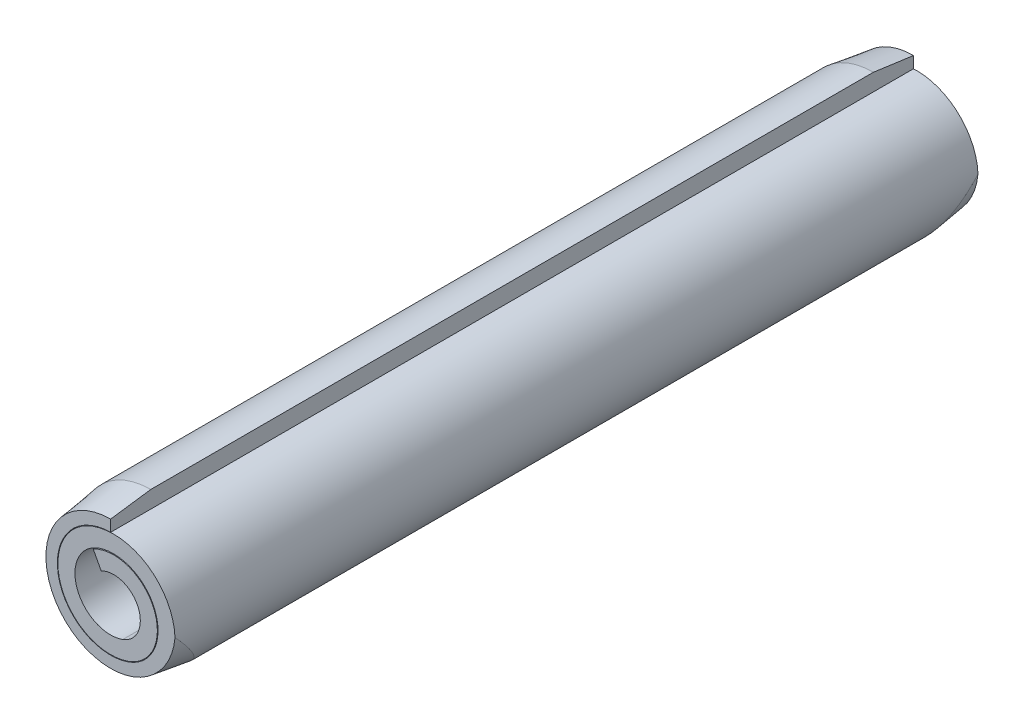
ISO-10303-21;
HEADER;
FILE_DESCRIPTION(('STEP AP214'),'2;1');
FILE_NAME('part.step','',(''),(''),'','','');
FILE_SCHEMA(('AUTOMOTIVE_DESIGN { 1 0 10303 214 1 1 1 1 }'));
ENDSEC;
DATA;
#1=APPLICATION_CONTEXT('core data for automotive mechanical design processes');
#2=APPLICATION_PROTOCOL_DEFINITION('international standard','automotive_design',2000,#1);
#3=PRODUCT_CONTEXT('',#1,'mechanical');
#4=PRODUCT('Part','Part','',(#3));
#5=PRODUCT_RELATED_PRODUCT_CATEGORY('part','',(#4));
#6=PRODUCT_DEFINITION_FORMATION('','',#4);
#7=PRODUCT_DEFINITION_CONTEXT('part definition',#1,'design');
#8=PRODUCT_DEFINITION('design','',#6,#7);
#9=PRODUCT_DEFINITION_SHAPE('','',#8);
#10=(LENGTH_UNIT() NAMED_UNIT(*) SI_UNIT(.MILLI.,.METRE.));
#11=(NAMED_UNIT(*) PLANE_ANGLE_UNIT() SI_UNIT($,.RADIAN.));
#12=(NAMED_UNIT(*) SI_UNIT($,.STERADIAN.) SOLID_ANGLE_UNIT());
#13=UNCERTAINTY_MEASURE_WITH_UNIT(LENGTH_MEASURE(1.E-05),#10,'distance_accuracy_value','');
#14=(GEOMETRIC_REPRESENTATION_CONTEXT(3) GLOBAL_UNCERTAINTY_ASSIGNED_CONTEXT((#13)) GLOBAL_UNIT_ASSIGNED_CONTEXT((#10,
#11,#12)) REPRESENTATION_CONTEXT('',''));
#15=CARTESIAN_POINT('',(0.,0.,0.));
#16=DIRECTION('',(0.,0.,1.));
#17=DIRECTION('',(1.,0.,0.));
#18=AXIS2_PLACEMENT_3D('',#15,#16,#17);
#19=CARTESIAN_POINT('',(0.,0.,-9.));
#20=DIRECTION('',(0.,0.,1.));
#21=DIRECTION('',(1.,0.,0.));
#22=AXIS2_PLACEMENT_3D('',#19,#20,#21);
#23=CYLINDRICAL_SURFACE('',#22,1.18125);
#24=CARTESIAN_POINT('',(0.,0.,-9.));
#25=DIRECTION('',(0.,0.,1.));
#26=DIRECTION('',(1.,0.,0.));
#27=AXIS2_PLACEMENT_3D('',#24,#25,#26);
#28=CIRCLE('',#27,1.18125);
#29=CARTESIAN_POINT('',(-0.404011294303447,1.11001190830335,-9.));
#30=VERTEX_POINT('',#29);
#31=CARTESIAN_POINT('',(0.404011294303442,-1.11001190830336,-9.));
#32=VERTEX_POINT('',#31);
#33=EDGE_CURVE('E245',#30,#32,#28,.T.);
#34=ORIENTED_EDGE('',*,*,#33,.T.);
#35=DIRECTION('',(0.,0.,1.));
#36=VECTOR('',#35,1.);
#37=CARTESIAN_POINT('',(0.404011294303446,-1.11001190830335,-9.));
#38=LINE('',#37,#36);
#39=CARTESIAN_POINT('',(0.404011294303443,-1.11001190830336,9.));
#40=VERTEX_POINT('',#39);
#41=EDGE_CURVE('E240',#40,#32,#38,.F.);
#42=ORIENTED_EDGE('',*,*,#41,.F.);
#43=CARTESIAN_POINT('',(0.,0.,9.));
#44=DIRECTION('',(0.,0.,1.));
#45=DIRECTION('',(1.,0.,0.));
#46=AXIS2_PLACEMENT_3D('',#43,#44,#45);
#47=CIRCLE('',#46,1.18125);
#48=CARTESIAN_POINT('',(-0.404011294303447,1.11001190830335,9.));
#49=VERTEX_POINT('',#48);
#50=EDGE_CURVE('E115',#49,#40,#47,.T.);
#51=ORIENTED_EDGE('',*,*,#50,.F.);
#52=DIRECTION('',(0.,0.,1.));
#53=VECTOR('',#52,1.);
#54=CARTESIAN_POINT('',(-0.404011294303447,1.11001190830335,-9.));
#55=LINE('',#54,#53);
#56=EDGE_CURVE('E111',#30,#49,#55,.T.);
#57=ORIENTED_EDGE('',*,*,#56,.F.);
#58=EDGE_LOOP('',(#34,#42,#51,#57));
#59=FACE_BOUND('',#58,.T.);
#60=ADVANCED_FACE('F18',(#59),#23,.T.);
#61=CARTESIAN_POINT('',(0.0689996919525346,-0.189575095588917,-9.));
#62=DIRECTION('',(0.,0.,1.));
#63=DIRECTION('',(1.,0.,0.));
#64=AXIS2_PLACEMENT_3D('',#61,#62,#63);
#65=CYLINDRICAL_SURFACE('',#64,0.979508397059278);
#66=DIRECTION('',(0.,0.,1.));
#67=VECTOR('',#66,1.);
#68=CARTESIAN_POINT('',(-0.390102521039357,0.675677386600868,-9.));
#69=LINE('',#68,#67);
#70=CARTESIAN_POINT('',(-0.390102521039357,0.675677386600868,-9.));
#71=VERTEX_POINT('',#70);
#72=CARTESIAN_POINT('',(-0.390102521039357,0.675677386600868,9.));
#73=VERTEX_POINT('',#72);
#74=EDGE_CURVE('E238',#71,#73,#69,.T.);
#75=ORIENTED_EDGE('',*,*,#74,.T.);
#76=CARTESIAN_POINT('',(0.0689996919525346,-0.189575095588917,9.));
#77=DIRECTION('',(0.,0.,1.));
#78=DIRECTION('',(1.,0.,0.));
#79=AXIS2_PLACEMENT_3D('',#76,#77,#78);
#80=CIRCLE('',#79,0.979508397059278);
#81=EDGE_CURVE('E225',#40,#73,#80,.T.);
#82=ORIENTED_EDGE('',*,*,#81,.F.);
#83=ORIENTED_EDGE('',*,*,#41,.T.);
#84=CARTESIAN_POINT('',(0.0689996919525346,-0.189575095588917,-9.));
#85=DIRECTION('',(0.,0.,1.));
#86=DIRECTION('',(1.,0.,0.));
#87=AXIS2_PLACEMENT_3D('',#84,#85,#86);
#88=CIRCLE('',#87,0.979508397059278);
#89=EDGE_CURVE('E217',#32,#71,#88,.T.);
#90=ORIENTED_EDGE('',*,*,#89,.T.);
#91=EDGE_LOOP('',(#75,#82,#83,#90));
#92=FACE_BOUND('',#91,.T.);
#93=ADVANCED_FACE('F175',(#92),#65,.T.);
#94=CARTESIAN_POINT('',(-0.211085830625034,0.338291437783564,-9.));
#95=DIRECTION('',(0.883353817881994,0.468706765935062,0.));
#96=DIRECTION('',(-0.468706765935062,0.883353817881994,0.));
#97=AXIS2_PLACEMENT_3D('',#94,#95,#96);
#98=PLANE('',#97);
#99=ORIENTED_EDGE('',*,*,#74,.F.);
#100=DIRECTION('',(0.468706765935062,-0.883353817881994,0.));
#101=VECTOR('',#100,1.);
#102=CARTESIAN_POINT('',(-0.390102521039357,0.675677386600868,-9.));
#103=LINE('',#102,#101);
#104=CARTESIAN_POINT('',(-0.211085830625034,0.338291437783564,-9.));
#105=VERTEX_POINT('',#104);
#106=EDGE_CURVE('E213',#71,#105,#103,.T.);
#107=ORIENTED_EDGE('',*,*,#106,.T.);
#108=DIRECTION('',(0.,0.,1.));
#109=VECTOR('',#108,1.);
#110=CARTESIAN_POINT('',(-0.211085830625034,0.338291437783564,-9.));
#111=LINE('',#110,#109);
#112=CARTESIAN_POINT('',(-0.211085830625034,0.338291437783564,9.));
#113=VERTEX_POINT('',#112);
#114=EDGE_CURVE('E235',#105,#113,#111,.T.);
#115=ORIENTED_EDGE('',*,*,#114,.T.);
#116=DIRECTION('',(0.468706765935062,-0.883353817881994,0.));
#117=VECTOR('',#116,1.);
#118=CARTESIAN_POINT('',(-0.390102521039357,0.675677386600868,9.));
#119=LINE('',#118,#117);
#120=EDGE_CURVE('E221',#73,#113,#119,.T.);
#121=ORIENTED_EDGE('',*,*,#120,.F.);
#122=EDGE_LOOP('',(#99,#107,#115,#121));
#123=FACE_BOUND('',#122,.T.);
#124=ADVANCED_FACE('F172',(#123),#98,.F.);
#125=CARTESIAN_POINT('',(0.0689996919525346,-0.189575095588917,-9.));
#126=DIRECTION('',(0.,0.,1.));
#127=DIRECTION('',(1.,0.,0.));
#128=AXIS2_PLACEMENT_3D('',#125,#126,#127);
#129=CYLINDRICAL_SURFACE('',#128,0.597570897059278);
#130=CARTESIAN_POINT('',(0.0689996919525346,-0.189575095588917,-9.));
#131=DIRECTION('',(0.,0.,1.));
#132=DIRECTION('',(1.,0.,0.));
#133=AXIS2_PLACEMENT_3D('',#130,#131,#132);
#134=CIRCLE('',#133,0.597570897059278);
#135=CARTESIAN_POINT('',(0.273380975811996,-0.751108057951937,-9.));
#136=VERTEX_POINT('',#135);
#137=EDGE_CURVE('E216',#105,#136,#134,.F.);
#138=ORIENTED_EDGE('',*,*,#137,.T.);
#139=DIRECTION('',(0.,0.,1.));
#140=VECTOR('',#139,1.);
#141=CARTESIAN_POINT('',(0.273380975811998,-0.751108057951936,-9.));
#142=LINE('',#141,#140);
#143=CARTESIAN_POINT('',(0.273380975811996,-0.751108057951937,9.));
#144=VERTEX_POINT('',#143);
#145=EDGE_CURVE('E233',#136,#144,#142,.T.);
#146=ORIENTED_EDGE('',*,*,#145,.T.);
#147=CARTESIAN_POINT('',(0.0689996919525346,-0.189575095588917,9.));
#148=DIRECTION('',(0.,0.,1.));
#149=DIRECTION('',(1.,0.,0.));
#150=AXIS2_PLACEMENT_3D('',#147,#148,#149);
#151=CIRCLE('',#150,0.597570897059278);
#152=EDGE_CURVE('E224',#113,#144,#151,.F.);
#153=ORIENTED_EDGE('',*,*,#152,.F.);
#154=ORIENTED_EDGE('',*,*,#114,.F.);
#155=EDGE_LOOP('',(#138,#146,#153,#154));
#156=FACE_BOUND('',#155,.T.);
#157=ADVANCED_FACE('F168',(#156),#129,.F.);
#158=CARTESIAN_POINT('',(0.,0.,-9.));
#159=DIRECTION('',(0.,0.,1.));
#160=DIRECTION('',(1.,0.,0.));
#161=AXIS2_PLACEMENT_3D('',#158,#159,#160);
#162=CYLINDRICAL_SURFACE('',#161,0.799312499999999);
#163=ORIENTED_EDGE('',*,*,#145,.F.);
#164=CARTESIAN_POINT('',(0.,0.,-9.));
#165=DIRECTION('',(0.,0.,1.));
#166=DIRECTION('',(1.,0.,0.));
#167=AXIS2_PLACEMENT_3D('',#164,#165,#166);
#168=CIRCLE('',#167,0.799312499999999);
#169=CARTESIAN_POINT('',(-0.273380975811999,0.751108057951935,-9.));
#170=VERTEX_POINT('',#169);
#171=EDGE_CURVE('E251',#136,#170,#168,.F.);
#172=ORIENTED_EDGE('',*,*,#171,.T.);
#173=DIRECTION('',(0.,0.,1.));
#174=VECTOR('',#173,1.);
#175=CARTESIAN_POINT('',(-0.273380975811999,0.751108057951935,-9.));
#176=LINE('',#175,#174);
#177=CARTESIAN_POINT('',(-0.273380975811999,0.751108057951935,9.));
#178=VERTEX_POINT('',#177);
#179=EDGE_CURVE('E229',#170,#178,#176,.T.);
#180=ORIENTED_EDGE('',*,*,#179,.T.);
#181=CARTESIAN_POINT('',(0.,0.,9.));
#182=DIRECTION('',(0.,0.,1.));
#183=DIRECTION('',(1.,0.,0.));
#184=AXIS2_PLACEMENT_3D('',#181,#182,#183);
#185=CIRCLE('',#184,0.799312499999999);
#186=EDGE_CURVE('E262',#144,#178,#185,.F.);
#187=ORIENTED_EDGE('',*,*,#186,.F.);
#188=EDGE_LOOP('',(#163,#172,#180,#187));
#189=FACE_BOUND('',#188,.T.);
#190=ADVANCED_FACE('F164',(#189),#162,.F.);
#191=CARTESIAN_POINT('',(0.0673352157172413,-0.185001984717226,-9.));
#192=DIRECTION('',(0.,0.,1.));
#193=DIRECTION('',(1.,0.,0.));
#194=AXIS2_PLACEMENT_3D('',#191,#192,#193);
#195=CYLINDRICAL_SURFACE('',#194,0.996187499999999);
#196=CARTESIAN_POINT('',(0.0673352157172413,-0.185001984717226,-9.));
#197=DIRECTION('',(0.,0.,1.));
#198=DIRECTION('',(1.,0.,0.));
#199=AXIS2_PLACEMENT_3D('',#196,#197,#198);
#200=CIRCLE('',#199,0.996187499999999);
#201=CARTESIAN_POINT('',(0.408051407246481,-1.12111202738639,-9.));
#202=VERTEX_POINT('',#201);
#203=EDGE_CURVE('E247',#170,#202,#200,.F.);
#204=ORIENTED_EDGE('',*,*,#203,.T.);
#205=DIRECTION('',(0.,0.,1.));
#206=VECTOR('',#205,1.);
#207=CARTESIAN_POINT('',(0.408051407246481,-1.12111202738639,-9.));
#208=LINE('',#207,#206);
#209=CARTESIAN_POINT('',(0.408051407246481,-1.12111202738639,9.));
#210=VERTEX_POINT('',#209);
#211=EDGE_CURVE('E116',#202,#210,#208,.T.);
#212=ORIENTED_EDGE('',*,*,#211,.T.);
#213=CARTESIAN_POINT('',(0.0673352157172413,-0.185001984717226,9.));
#214=DIRECTION('',(0.,0.,1.));
#215=DIRECTION('',(1.,0.,0.));
#216=AXIS2_PLACEMENT_3D('',#213,#214,#215);
#217=CIRCLE('',#216,0.996187499999999);
#218=EDGE_CURVE('E259',#178,#210,#217,.F.);
#219=ORIENTED_EDGE('',*,*,#218,.F.);
#220=ORIENTED_EDGE('',*,*,#179,.F.);
#221=EDGE_LOOP('',(#204,#212,#219,#220));
#222=FACE_BOUND('',#221,.T.);
#223=ADVANCED_FACE('F160',(#222),#195,.F.);
#224=CARTESIAN_POINT('',(0.,0.,-9.));
#225=DIRECTION('',(0.,0.,1.));
#226=DIRECTION('',(1.,0.,0.));
#227=AXIS2_PLACEMENT_3D('',#224,#225,#226);
#228=CYLINDRICAL_SURFACE('',#227,1.1930625);
#229=ORIENTED_EDGE('',*,*,#211,.F.);
#230=CARTESIAN_POINT('',(0.,0.,-9.));
#231=DIRECTION('',(0.,0.,1.));
#232=DIRECTION('',(1.,0.,0.));
#233=AXIS2_PLACEMENT_3D('',#230,#231,#232);
#234=CIRCLE('',#233,1.1930625);
#235=CARTESIAN_POINT('',(0.,1.1930625,-9.));
#236=VERTEX_POINT('',#235);
#237=EDGE_CURVE('E246',#202,#236,#234,.F.);
#238=ORIENTED_EDGE('',*,*,#237,.T.);
#239=DIRECTION('',(0.,0.,1.));
#240=VECTOR('',#239,1.);
#241=CARTESIAN_POINT('',(0.,1.1930625,-9.));
#242=LINE('',#241,#240);
#243=CARTESIAN_POINT('',(0.,1.1930625,9.));
#244=VERTEX_POINT('',#243);
#245=EDGE_CURVE('E125',#236,#244,#242,.T.);
#246=ORIENTED_EDGE('',*,*,#245,.T.);
#247=CARTESIAN_POINT('',(0.,0.,9.));
#248=DIRECTION('',(0.,0.,1.));
#249=DIRECTION('',(1.,0.,0.));
#250=AXIS2_PLACEMENT_3D('',#247,#248,#249);
#251=CIRCLE('',#250,1.1930625);
#252=EDGE_CURVE('E257',#210,#244,#251,.F.);
#253=ORIENTED_EDGE('',*,*,#252,.F.);
#254=EDGE_LOOP('',(#229,#238,#246,#253));
#255=FACE_BOUND('',#254,.T.);
#256=ADVANCED_FACE('F157',(#255),#228,.F.);
#257=CARTESIAN_POINT('',(0.0689996919525346,-0.189575095588917,9.));
#258=DIRECTION('',(0.,0.,1.));
#259=DIRECTION('',(1.,0.,0.));
#260=AXIS2_PLACEMENT_3D('',#257,#258,#259);
#261=PLANE('',#260);
#262=ORIENTED_EDGE('',*,*,#252,.T.);
#263=DIRECTION('',(0.,-1.,0.));
#264=VECTOR('',#263,1.);
#265=CARTESIAN_POINT('',(0.,1.575,9.));
#266=LINE('',#265,#264);
#267=CARTESIAN_POINT('',(0.,1.45000000000275,9.00000000000728));
#268=VERTEX_POINT('',#267);
#269=EDGE_CURVE('E122',#244,#268,#266,.F.);
#270=ORIENTED_EDGE('',*,*,#269,.T.);
#271=CARTESIAN_POINT('',(0.,0.,9.00000000001455));
#272=DIRECTION('',(0.,0.,-1.));
#273=DIRECTION('',(-1.,0.,0.));
#274=AXIS2_PLACEMENT_3D('',#271,#272,#273);
#275=CIRCLE('',#274,1.4500000000055);
#276=CARTESIAN_POINT('',(1.44429938850239,-0.128449509098267,8.99999999999184));
#277=VERTEX_POINT('',#276);
#278=EDGE_CURVE('E118',#277,#268,#275,.T.);
#279=ORIENTED_EDGE('',*,*,#278,.F.);
#280=CARTESIAN_POINT('',(0.0673352157172413,-0.185001984717226,9.));
#281=DIRECTION('',(0.,0.,1.));
#282=DIRECTION('',(1.,0.,0.));
#283=AXIS2_PLACEMENT_3D('',#280,#281,#282);
#284=CIRCLE('',#283,1.378125);
#285=EDGE_CURVE('E21',#277,#49,#284,.T.);
#286=ORIENTED_EDGE('',*,*,#285,.T.);
#287=ORIENTED_EDGE('',*,*,#50,.T.);
#288=ORIENTED_EDGE('',*,*,#81,.T.);
#289=ORIENTED_EDGE('',*,*,#120,.T.);
#290=ORIENTED_EDGE('',*,*,#152,.T.);
#291=ORIENTED_EDGE('',*,*,#186,.T.);
#292=ORIENTED_EDGE('',*,*,#218,.T.);
#293=EDGE_LOOP('',(#262,#270,#279,#286,#287,#288,#289,#290,#291,#292));
#294=FACE_BOUND('',#293,.T.);
#295=ADVANCED_FACE('F120',(#294),#261,.T.);
#296=CARTESIAN_POINT('',(0.0689996919525346,-0.189575095588917,-9.));
#297=DIRECTION('',(0.,0.,1.));
#298=DIRECTION('',(1.,0.,0.));
#299=AXIS2_PLACEMENT_3D('',#296,#297,#298);
#300=PLANE('',#299);
#301=CARTESIAN_POINT('',(0.0673352157172413,-0.185001984717226,-9.));
#302=DIRECTION('',(0.,0.,1.));
#303=DIRECTION('',(1.,0.,0.));
#304=AXIS2_PLACEMENT_3D('',#301,#302,#303);
#305=CIRCLE('',#304,1.378125);
#306=CARTESIAN_POINT('',(1.44429938849764,-0.12844950904924,-8.99999999998456));
#307=VERTEX_POINT('',#306);
#308=EDGE_CURVE('E132',#307,#30,#305,.T.);
#309=ORIENTED_EDGE('',*,*,#308,.F.);
#310=CARTESIAN_POINT('',(0.,0.,-9.00000000001455));
#311=DIRECTION('',(0.,0.,1.));
#312=DIRECTION('',(1.,0.,0.));
#313=AXIS2_PLACEMENT_3D('',#310,#311,#312);
#314=CIRCLE('',#313,1.44999999999287);
#315=CARTESIAN_POINT('',(0.,1.44999999999827,-9.00000000003934));
#316=VERTEX_POINT('',#315);
#317=EDGE_CURVE('E206',#316,#307,#314,.T.);
#318=ORIENTED_EDGE('',*,*,#317,.F.);
#319=DIRECTION('',(0.,-1.,0.));
#320=VECTOR('',#319,1.);
#321=CARTESIAN_POINT('',(0.,1.575,-9.));
#322=LINE('',#321,#320);
#323=EDGE_CURVE('E204',#316,#236,#322,.T.);
#324=ORIENTED_EDGE('',*,*,#323,.T.);
#325=ORIENTED_EDGE('',*,*,#237,.F.);
#326=ORIENTED_EDGE('',*,*,#203,.F.);
#327=ORIENTED_EDGE('',*,*,#171,.F.);
#328=ORIENTED_EDGE('',*,*,#137,.F.);
#329=ORIENTED_EDGE('',*,*,#106,.F.);
#330=ORIENTED_EDGE('',*,*,#89,.F.);
#331=ORIENTED_EDGE('',*,*,#33,.F.);
#332=EDGE_LOOP('',(#309,#318,#324,#325,#326,#327,#328,#329,#330,#331));
#333=FACE_BOUND('',#332,.T.);
#334=ADVANCED_FACE('F150',(#333),#300,.F.);
#335=CARTESIAN_POINT('',(0.0673352157172413,-0.185001984717226,-9.));
#336=DIRECTION('',(0.,0.,1.));
#337=DIRECTION('',(1.,0.,0.));
#338=AXIS2_PLACEMENT_3D('',#335,#336,#337);
#339=CYLINDRICAL_SURFACE('',#338,1.378125);
#340=CARTESIAN_POINT('',(0.538681725737929,-1.4800158777378,8.10000000013377));
#341=CARTESIAN_POINT('',(0.568457575291803,-1.46918224784146,8.09999713101628));
#342=CARTESIAN_POINT('',(0.597839499243149,-1.45732031822733,8.10098429130596));
#343=CARTESIAN_POINT('',(0.655594090129831,-1.43166818089949,8.10490183378926));
#344=CARTESIAN_POINT('',(0.683967372478444,-1.41787917521204,8.10783100887027));
#345=CARTESIAN_POINT('',(0.766848538637026,-1.3740290993974,8.1194154940751));
#346=CARTESIAN_POINT('',(0.81960506885657,-1.341305849971,8.13086913587589));
#347=CARTESIAN_POINT('',(0.918863502551451,-1.27029254251756,8.16049297442889));
#348=CARTESIAN_POINT('',(0.96537807650679,-1.23201410026104,8.17864927546407));
#349=CARTESIAN_POINT('',(1.05175685498751,-1.15125624233099,8.22072898540391));
#350=CARTESIAN_POINT('',(1.09160909000056,-1.10876947946312,8.24466258924759));
#351=CARTESIAN_POINT('',(1.17710475141354,-1.00570152050876,8.30644462732102));
#352=CARTESIAN_POINT('',(1.21994637778338,-0.94396400770329,8.34623810526463));
#353=CARTESIAN_POINT('',(1.29370887157189,-0.817925509819064,8.43232155733951));
#354=CARTESIAN_POINT('',(1.32460475054872,-0.753619458310552,8.47862487616102));
#355=CARTESIAN_POINT('',(1.38325770469767,-0.604341069078207,8.59105648021897));
#356=CARTESIAN_POINT('',(1.40709324711935,-0.519124290581854,8.6588889312314));
#357=CARTESIAN_POINT('',(1.4381893089006,-0.350375391468493,8.79985561180971));
#358=CARTESIAN_POINT('',(1.44546431248184,-0.266841862082574,8.87298515060624));
#359=CARTESIAN_POINT('',(1.44545926734964,-0.166056720465984,8.96510866235574));
#360=CARTESIAN_POINT('',(1.44506824309714,-0.147202216420696,8.98251560370121));
#361=CARTESIAN_POINT('',(1.44429938849979,-0.12844950910148,9.00000000003114));
#362=B_SPLINE_CURVE_WITH_KNOTS('',3,(#340,#341,#342,#343,#344,#345,#346,#347,#348,#349,#350,
#351,#352,#353,#354,#355,#356,#357,#358,#359,#360,#361),.UNSPECIFIED.,.F.,.F.,(4,2,2,2,2,2,2,2,
2,2,4),(0.,0.094986772427458,0.189914558504253,0.378235945696181,0.566169084306071,
0.754436315914468,1.00814215783727,1.26237587384423,1.59518693674742,1.92770680354646,
2.00468244131442),.UNSPECIFIED.);
#363=CARTESIAN_POINT('',(0.538681725737929,-1.48001587773781,8.10000000006688));
#364=VERTEX_POINT('',#363);
#365=EDGE_CURVE('E108',#364,#277,#362,.T.);
#366=ORIENTED_EDGE('',*,*,#365,.F.);
#367=DIRECTION('',(0.,0.,1.));
#368=VECTOR('',#367,1.);
#369=CARTESIAN_POINT('',(0.538681725737929,-1.48001587773781,-9.));
#370=LINE('',#369,#368);
#371=CARTESIAN_POINT('',(0.538681725737928,-1.48001587773781,-8.09999999999867));
#372=VERTEX_POINT('',#371);
#373=EDGE_CURVE('E208',#372,#364,#370,.T.);
#374=ORIENTED_EDGE('',*,*,#373,.F.);
#375=CARTESIAN_POINT('',(0.538681725737928,-1.4800158777378,-8.09999999999733));
#376=CARTESIAN_POINT('',(0.568457575291395,-1.46918224784161,-8.09999713087984));
#377=CARTESIAN_POINT('',(0.597839499242344,-1.45732031822765,-8.10098429116955));
#378=CARTESIAN_POINT('',(0.65559409012825,-1.43166818090023,-8.10490183365294));
#379=CARTESIAN_POINT('',(0.683967372476484,-1.41787917521301,-8.10783100873402));
#380=CARTESIAN_POINT('',(0.766848538633942,-1.37402909939916,-8.1194154939391));
#381=CARTESIAN_POINT('',(0.819605068852773,-1.34130584997342,-8.13086913574014));
#382=CARTESIAN_POINT('',(0.918863502546321,-1.27029254252153,-8.16049297429373));
#383=CARTESIAN_POINT('',(0.965378076501043,-1.23201410026591,-8.17864927532924));
#384=CARTESIAN_POINT('',(1.05175685498068,-1.15125624233788,-8.22072898526982));
#385=CARTESIAN_POINT('',(1.09160908999328,-1.10876947947113,-8.24466258911388));
#386=CARTESIAN_POINT('',(1.17710475140619,-1.00570152051867,-8.30644462718879));
#387=CARTESIAN_POINT('',(1.21994637777632,-0.943964007713967,-8.34623810513363));
#388=CARTESIAN_POINT('',(1.29370887156546,-0.81792550983145,-8.43232155721112));
#389=CARTESIAN_POINT('',(1.32460475054265,-0.753619458323875,-8.478624876034));
#390=CARTESIAN_POINT('',(1.38325770469673,-0.604341069083359,-8.59105648010306));
#391=CARTESIAN_POINT('',(1.40709324712093,-0.519124290577792,-8.65888893112626));
#392=CARTESIAN_POINT('',(1.43818930890378,-0.350375391446725,-8.79985561172717));
#393=CARTESIAN_POINT('',(1.44546431248411,-0.266841862052312,-8.87298515053553));
#394=CARTESIAN_POINT('',(1.44545926734911,-0.166056720425262,-8.96510866230048));
#395=CARTESIAN_POINT('',(1.44506824309599,-0.147202216377494,-8.98251560364938));
#396=CARTESIAN_POINT('',(1.44429938849792,-0.128449509055837,-8.99999999998275));
#397=B_SPLINE_CURVE_WITH_KNOTS('',3,(#375,#376,#377,#378,#379,#380,#381,#382,#383,#384,#385,
#386,#387,#388,#389,#390,#391,#392,#393,#394,#395,#396),.UNSPECIFIED.,.F.,.F.,(4,2,2,2,2,2,2,2,
2,2,4),(0.,0.0949867724261566,0.189914558501646,0.378235945690907,0.566169084298098,
0.754436315903807,1.00814215782707,1.26237587383457,1.59518693677959,1.92770680362058,
2.004682441401),.UNSPECIFIED.);
#398=EDGE_CURVE('E130',#372,#307,#397,.T.);
#399=ORIENTED_EDGE('',*,*,#398,.T.);
#400=ORIENTED_EDGE('',*,*,#308,.T.);
#401=ORIENTED_EDGE('',*,*,#56,.T.);
#402=ORIENTED_EDGE('',*,*,#285,.F.);
#403=EDGE_LOOP('',(#366,#374,#399,#400,#401,#402));
#404=FACE_BOUND('',#403,.T.);
#405=ADVANCED_FACE('F105',(#404),#339,.T.);
#406=CARTESIAN_POINT('',(0.,0.,8.1000000000131));
#407=DIRECTION('',(0.,0.,-1.));
#408=DIRECTION('',(-1.,0.,0.));
#409=AXIS2_PLACEMENT_3D('',#406,#407,#408);
#410=CONICAL_SURFACE('',#409,1.57500000001676,0.138006023669568);
#411=DIRECTION('',(0.,0.137568371274688,-0.990492273177751));
#412=VECTOR('',#411,1.);
#413=CARTESIAN_POINT('',(0.,1.45,9.));
#414=LINE('',#413,#412);
#415=CARTESIAN_POINT('',(0.,1.57500000000838,8.10000000000656));
#416=VERTEX_POINT('',#415);
#417=EDGE_CURVE('E218',#268,#416,#414,.T.);
#418=ORIENTED_EDGE('',*,*,#417,.T.);
#419=CARTESIAN_POINT('',(0.,0.,8.1));
#420=DIRECTION('',(0.,0.,1.));
#421=DIRECTION('',(1.,0.,0.));
#422=AXIS2_PLACEMENT_3D('',#419,#420,#421);
#423=CIRCLE('',#422,1.575);
#424=EDGE_CURVE('E27',#364,#416,#423,.F.);
#425=ORIENTED_EDGE('',*,*,#424,.F.);
#426=ORIENTED_EDGE('',*,*,#365,.T.);
#427=ORIENTED_EDGE('',*,*,#278,.T.);
#428=EDGE_LOOP('',(#418,#425,#426,#427));
#429=FACE_BOUND('',#428,.T.);
#430=ADVANCED_FACE('F127',(#429),#410,.T.);
#431=CARTESIAN_POINT('',(0.,1.575,-9.));
#432=DIRECTION('',(-1.,0.,0.));
#433=DIRECTION('',(0.,-1.,0.));
#434=AXIS2_PLACEMENT_3D('',#431,#432,#433);
#435=PLANE('',#434);
#436=DIRECTION('',(0.,-0.137568371274689,-0.990492273177752));
#437=VECTOR('',#436,1.);
#438=CARTESIAN_POINT('',(8.48781333205985E-12,69308.255555556,499000.));
#439=LINE('',#438,#437);
#440=CARTESIAN_POINT('',(0.,1.57500000000419,-8.10000000000326));
#441=VERTEX_POINT('',#440);
#442=EDGE_CURVE('E201',#441,#316,#439,.T.);
#443=ORIENTED_EDGE('',*,*,#442,.F.);
#444=DIRECTION('',(0.,0.,1.));
#445=VECTOR('',#444,1.);
#446=CARTESIAN_POINT('',(0.,1.575,-9.));
#447=LINE('',#446,#445);
#448=EDGE_CURVE('E11',#416,#441,#447,.F.);
#449=ORIENTED_EDGE('',*,*,#448,.F.);
#450=ORIENTED_EDGE('',*,*,#417,.F.);
#451=ORIENTED_EDGE('',*,*,#269,.F.);
#452=ORIENTED_EDGE('',*,*,#245,.F.);
#453=ORIENTED_EDGE('',*,*,#323,.F.);
#454=EDGE_LOOP('',(#443,#449,#450,#451,#452,#453));
#455=FACE_BOUND('',#454,.T.);
#456=ADVANCED_FACE('F192',(#455),#435,.F.);
#457=CARTESIAN_POINT('',(0.,0.,-8.10000000018363));
#458=DIRECTION('',(0.,0.,1.));
#459=DIRECTION('',(1.,0.,0.));
#460=AXIS2_PLACEMENT_3D('',#457,#458,#459);
#461=CONICAL_SURFACE('',#460,1.57499999997413,0.138006023662683);
#462=CARTESIAN_POINT('',(0.,0.,-8.1));
#463=DIRECTION('',(0.,0.,1.));
#464=DIRECTION('',(1.,0.,0.));
#465=AXIS2_PLACEMENT_3D('',#462,#463,#464);
#466=CIRCLE('',#465,1.575);
#467=EDGE_CURVE('E36',#441,#372,#466,.T.);
#468=ORIENTED_EDGE('',*,*,#467,.F.);
#469=ORIENTED_EDGE('',*,*,#442,.T.);
#470=ORIENTED_EDGE('',*,*,#317,.T.);
#471=ORIENTED_EDGE('',*,*,#398,.F.);
#472=EDGE_LOOP('',(#468,#469,#470,#471));
#473=FACE_BOUND('',#472,.T.);
#474=ADVANCED_FACE('F186',(#473),#461,.T.);
#475=CARTESIAN_POINT('',(0.,0.,-9.));
#476=DIRECTION('',(0.,0.,1.));
#477=DIRECTION('',(1.,0.,0.));
#478=AXIS2_PLACEMENT_3D('',#475,#476,#477);
#479=CYLINDRICAL_SURFACE('',#478,1.575);
#480=ORIENTED_EDGE('',*,*,#448,.T.);
#481=ORIENTED_EDGE('',*,*,#467,.T.);
#482=ORIENTED_EDGE('',*,*,#373,.T.);
#483=ORIENTED_EDGE('',*,*,#424,.T.);
#484=EDGE_LOOP('',(#480,#481,#482,#483));
#485=FACE_BOUND('',#484,.T.);
#486=ADVANCED_FACE('F184',(#485),#479,.T.);
#487=CLOSED_SHELL('',(#60,#93,#124,#157,#190,#223,#256,#295,#334,#405,#430,#456,#474,#486));
#488=MANIFOLD_SOLID_BREP('B1',#487);
#489=ADVANCED_BREP_SHAPE_REPRESENTATION('',(#18,#488),#14);
#490=SHAPE_DEFINITION_REPRESENTATION(#9,#489);
ENDSEC;
END-ISO-10303-21;
